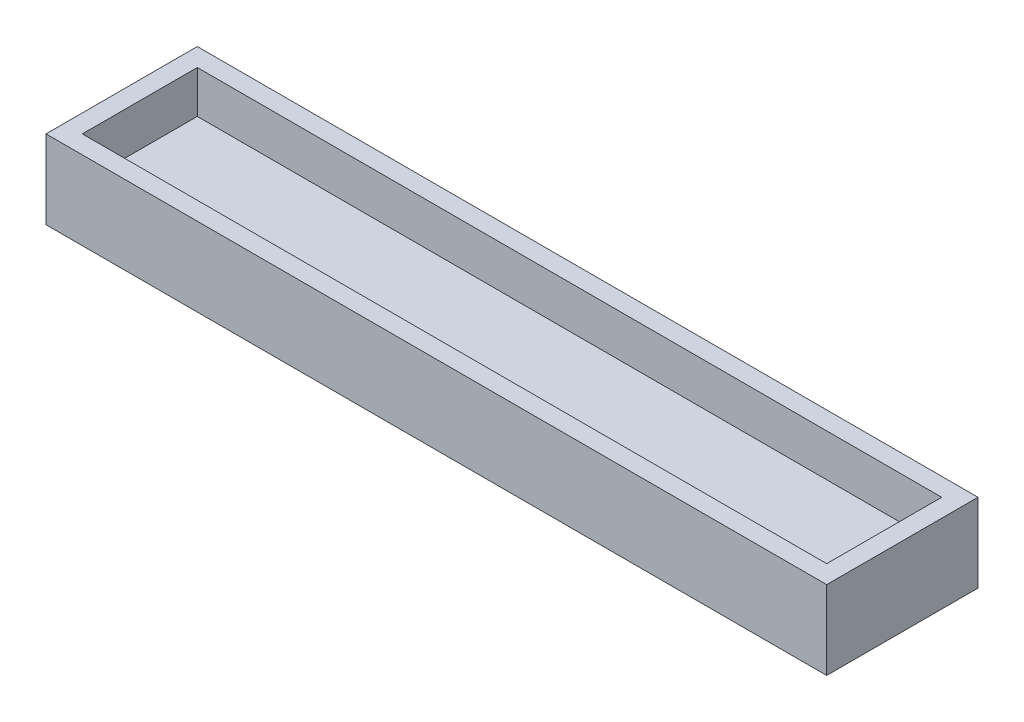
ISO-10303-21;
HEADER;
FILE_DESCRIPTION(('STEP AP214'),'2;1');
FILE_NAME('part.step','',(''),(''),'','','');
FILE_SCHEMA(('AUTOMOTIVE_DESIGN { 1 0 10303 214 1 1 1 1 }'));
ENDSEC;
DATA;
#1=APPLICATION_CONTEXT('core data for automotive mechanical design processes');
#2=APPLICATION_PROTOCOL_DEFINITION('international standard','automotive_design',2000,#1);
#3=PRODUCT_CONTEXT('',#1,'mechanical');
#4=PRODUCT('Part','Part','',(#3));
#5=PRODUCT_RELATED_PRODUCT_CATEGORY('part','',(#4));
#6=PRODUCT_DEFINITION_FORMATION('','',#4);
#7=PRODUCT_DEFINITION_CONTEXT('part definition',#1,'design');
#8=PRODUCT_DEFINITION('design','',#6,#7);
#9=PRODUCT_DEFINITION_SHAPE('','',#8);
#10=(LENGTH_UNIT() NAMED_UNIT(*) SI_UNIT(.MILLI.,.METRE.));
#11=(NAMED_UNIT(*) PLANE_ANGLE_UNIT() SI_UNIT($,.RADIAN.));
#12=(NAMED_UNIT(*) SI_UNIT($,.STERADIAN.) SOLID_ANGLE_UNIT());
#13=UNCERTAINTY_MEASURE_WITH_UNIT(LENGTH_MEASURE(1.E-05),#10,'distance_accuracy_value','');
#14=(GEOMETRIC_REPRESENTATION_CONTEXT(3) GLOBAL_UNCERTAINTY_ASSIGNED_CONTEXT((#13)) GLOBAL_UNIT_ASSIGNED_CONTEXT((#10,
#11,#12)) REPRESENTATION_CONTEXT('',''));
#15=CARTESIAN_POINT('',(0.,0.,0.));
#16=DIRECTION('',(0.,0.,1.));
#17=DIRECTION('',(1.,0.,0.));
#18=AXIS2_PLACEMENT_3D('',#15,#16,#17);
#19=CARTESIAN_POINT('',(0.,6.,0.));
#20=DIRECTION('',(0.,-1.,0.));
#21=DIRECTION('',(0.,0.,-1.));
#22=AXIS2_PLACEMENT_3D('',#19,#20,#21);
#23=PLANE('',#22);
#24=DIRECTION('',(0.,0.,1.));
#25=VECTOR('',#24,1.);
#26=CARTESIAN_POINT('',(0.,6.,0.));
#27=LINE('',#26,#25);
#28=CARTESIAN_POINT('',(0.,6.00000000000001,-19.));
#29=VERTEX_POINT('',#28);
#30=CARTESIAN_POINT('',(0.,6.,0.));
#31=VERTEX_POINT('',#30);
#32=EDGE_CURVE('E160',#29,#31,#27,.T.);
#33=ORIENTED_EDGE('',*,*,#32,.T.);
#34=DIRECTION('',(1.,0.,0.));
#35=VECTOR('',#34,1.);
#36=CARTESIAN_POINT('',(0.,6.,0.));
#37=LINE('',#36,#35);
#38=CARTESIAN_POINT('',(123.,6.00000000000001,0.));
#39=VERTEX_POINT('',#38);
#40=EDGE_CURVE('E164',#31,#39,#37,.T.);
#41=ORIENTED_EDGE('',*,*,#40,.T.);
#42=DIRECTION('',(0.,0.,-1.));
#43=VECTOR('',#42,1.);
#44=CARTESIAN_POINT('',(123.,6.,0.));
#45=LINE('',#44,#43);
#46=CARTESIAN_POINT('',(123.,6.00000000000001,-19.));
#47=VERTEX_POINT('',#46);
#48=EDGE_CURVE('E50',#39,#47,#45,.T.);
#49=ORIENTED_EDGE('',*,*,#48,.T.);
#50=DIRECTION('',(-1.,0.,0.));
#51=VECTOR('',#50,1.);
#52=CARTESIAN_POINT('',(0.,6.,-19.));
#53=LINE('',#52,#51);
#54=EDGE_CURVE('E12',#47,#29,#53,.T.);
#55=ORIENTED_EDGE('',*,*,#54,.T.);
#56=EDGE_LOOP('',(#33,#41,#49,#55));
#57=FACE_BOUND('',#56,.T.);
#58=ADVANCED_FACE('F41',(#57),#23,.F.);
#59=CARTESIAN_POINT('',(0.,151.400152206913,-19.));
#60=DIRECTION('',(0.,0.,-1.));
#61=DIRECTION('',(-1.,0.,0.));
#62=AXIS2_PLACEMENT_3D('',#59,#60,#61);
#63=PLANE('',#62);
#64=DIRECTION('',(0.,-1.,0.));
#65=VECTOR('',#64,1.);
#66=CARTESIAN_POINT('',(0.,151.400152206913,-19.));
#67=LINE('',#66,#65);
#68=CARTESIAN_POINT('',(0.,13.,-19.));
#69=VERTEX_POINT('',#68);
#70=EDGE_CURVE('E140',#69,#29,#67,.T.);
#71=ORIENTED_EDGE('',*,*,#70,.T.);
#72=ORIENTED_EDGE('',*,*,#54,.F.);
#73=DIRECTION('',(0.,-1.,0.));
#74=VECTOR('',#73,1.);
#75=CARTESIAN_POINT('',(123.,151.400152206913,-19.));
#76=LINE('',#75,#74);
#77=CARTESIAN_POINT('',(123.,13.,-19.));
#78=VERTEX_POINT('',#77);
#79=EDGE_CURVE('E177',#78,#47,#76,.T.);
#80=ORIENTED_EDGE('',*,*,#79,.F.);
#81=DIRECTION('',(-1.,0.,0.));
#82=VECTOR('',#81,1.);
#83=CARTESIAN_POINT('',(0.,13.,-19.));
#84=LINE('',#83,#82);
#85=EDGE_CURVE('E150',#78,#69,#84,.T.);
#86=ORIENTED_EDGE('',*,*,#85,.T.);
#87=EDGE_LOOP('',(#71,#72,#80,#86));
#88=FACE_BOUND('',#87,.T.);
#89=ADVANCED_FACE('F202',(#88),#63,.F.);
#90=CARTESIAN_POINT('',(123.,151.400152206913,0.));
#91=DIRECTION('',(1.,0.,0.));
#92=DIRECTION('',(0.,0.,-1.));
#93=AXIS2_PLACEMENT_3D('',#90,#91,#92);
#94=PLANE('',#93);
#95=ORIENTED_EDGE('',*,*,#79,.T.);
#96=ORIENTED_EDGE('',*,*,#48,.F.);
#97=DIRECTION('',(0.,-1.,0.));
#98=VECTOR('',#97,1.);
#99=CARTESIAN_POINT('',(123.,151.400152206913,0.));
#100=LINE('',#99,#98);
#101=CARTESIAN_POINT('',(123.,13.,0.));
#102=VERTEX_POINT('',#101);
#103=EDGE_CURVE('E137',#102,#39,#100,.T.);
#104=ORIENTED_EDGE('',*,*,#103,.F.);
#105=DIRECTION('',(0.,0.,-1.));
#106=VECTOR('',#105,1.);
#107=CARTESIAN_POINT('',(123.,13.,0.));
#108=LINE('',#107,#106);
#109=EDGE_CURVE('E195',#102,#78,#108,.T.);
#110=ORIENTED_EDGE('',*,*,#109,.T.);
#111=EDGE_LOOP('',(#95,#96,#104,#110));
#112=FACE_BOUND('',#111,.T.);
#113=ADVANCED_FACE('F174',(#112),#94,.F.);
#114=CARTESIAN_POINT('',(0.,151.400152206913,0.));
#115=DIRECTION('',(0.,0.,1.));
#116=DIRECTION('',(1.,0.,0.));
#117=AXIS2_PLACEMENT_3D('',#114,#115,#116);
#118=PLANE('',#117);
#119=ORIENTED_EDGE('',*,*,#103,.T.);
#120=ORIENTED_EDGE('',*,*,#40,.F.);
#121=DIRECTION('',(0.,-1.,0.));
#122=VECTOR('',#121,1.);
#123=CARTESIAN_POINT('',(0.,151.400152206913,0.));
#124=LINE('',#123,#122);
#125=CARTESIAN_POINT('',(0.,13.,0.));
#126=VERTEX_POINT('',#125);
#127=EDGE_CURVE('E57',#126,#31,#124,.T.);
#128=ORIENTED_EDGE('',*,*,#127,.F.);
#129=DIRECTION('',(1.,0.,0.));
#130=VECTOR('',#129,1.);
#131=CARTESIAN_POINT('',(0.,13.,0.));
#132=LINE('',#131,#130);
#133=EDGE_CURVE('E180',#126,#102,#132,.T.);
#134=ORIENTED_EDGE('',*,*,#133,.T.);
#135=EDGE_LOOP('',(#119,#120,#128,#134));
#136=FACE_BOUND('',#135,.T.);
#137=ADVANCED_FACE('F179',(#136),#118,.F.);
#138=CARTESIAN_POINT('',(0.,151.400152206913,0.));
#139=DIRECTION('',(-1.,0.,0.));
#140=DIRECTION('',(0.,0.,1.));
#141=AXIS2_PLACEMENT_3D('',#138,#139,#140);
#142=PLANE('',#141);
#143=ORIENTED_EDGE('',*,*,#127,.T.);
#144=ORIENTED_EDGE('',*,*,#32,.F.);
#145=ORIENTED_EDGE('',*,*,#70,.F.);
#146=DIRECTION('',(0.,0.,1.));
#147=VECTOR('',#146,1.);
#148=CARTESIAN_POINT('',(0.,13.,0.));
#149=LINE('',#148,#147);
#150=EDGE_CURVE('E187',#69,#126,#149,.T.);
#151=ORIENTED_EDGE('',*,*,#150,.T.);
#152=EDGE_LOOP('',(#143,#144,#145,#151));
#153=FACE_BOUND('',#152,.T.);
#154=ADVANCED_FACE('F205',(#153),#142,.F.);
#155=CARTESIAN_POINT('',(-3.,151.400152206913,3.));
#156=DIRECTION('',(-1.,0.,0.));
#157=DIRECTION('',(0.,0.,1.));
#158=AXIS2_PLACEMENT_3D('',#155,#156,#157);
#159=PLANE('',#158);
#160=DIRECTION('',(0.,0.,1.));
#161=VECTOR('',#160,1.);
#162=CARTESIAN_POINT('',(-3.,13.,3.));
#163=LINE('',#162,#161);
#164=CARTESIAN_POINT('',(-3.,13.,-22.));
#165=VERTEX_POINT('',#164);
#166=CARTESIAN_POINT('',(-3.,13.,3.));
#167=VERTEX_POINT('',#166);
#168=EDGE_CURVE('E165',#165,#167,#163,.T.);
#169=ORIENTED_EDGE('',*,*,#168,.F.);
#170=DIRECTION('',(0.,-1.,0.));
#171=VECTOR('',#170,1.);
#172=CARTESIAN_POINT('',(-3.,151.400152206913,-22.));
#173=LINE('',#172,#171);
#174=CARTESIAN_POINT('',(-3.,0.,-22.));
#175=VERTEX_POINT('',#174);
#176=EDGE_CURVE('E120',#165,#175,#173,.T.);
#177=ORIENTED_EDGE('',*,*,#176,.T.);
#178=DIRECTION('',(0.,0.,-1.));
#179=VECTOR('',#178,1.);
#180=CARTESIAN_POINT('',(-3.,0.,3.));
#181=LINE('',#180,#179);
#182=CARTESIAN_POINT('',(-3.,0.,3.));
#183=VERTEX_POINT('',#182);
#184=EDGE_CURVE('E124',#183,#175,#181,.T.);
#185=ORIENTED_EDGE('',*,*,#184,.F.);
#186=DIRECTION('',(0.,-1.,0.));
#187=VECTOR('',#186,1.);
#188=CARTESIAN_POINT('',(-3.,151.400152206913,3.));
#189=LINE('',#188,#187);
#190=EDGE_CURVE('E109',#167,#183,#189,.T.);
#191=ORIENTED_EDGE('',*,*,#190,.F.);
#192=EDGE_LOOP('',(#169,#177,#185,#191));
#193=FACE_BOUND('',#192,.T.);
#194=ADVANCED_FACE('F125',(#193),#159,.T.);
#195=CARTESIAN_POINT('',(-3.,151.400152206913,-22.));
#196=DIRECTION('',(0.,0.,-1.));
#197=DIRECTION('',(-1.,0.,0.));
#198=AXIS2_PLACEMENT_3D('',#195,#196,#197);
#199=PLANE('',#198);
#200=DIRECTION('',(-1.,0.,0.));
#201=VECTOR('',#200,1.);
#202=CARTESIAN_POINT('',(-3.,13.,-22.));
#203=LINE('',#202,#201);
#204=CARTESIAN_POINT('',(126.,13.,-22.));
#205=VERTEX_POINT('',#204);
#206=EDGE_CURVE('E159',#205,#165,#203,.T.);
#207=ORIENTED_EDGE('',*,*,#206,.F.);
#208=DIRECTION('',(0.,-1.,0.));
#209=VECTOR('',#208,1.);
#210=CARTESIAN_POINT('',(126.,151.400152206913,-22.));
#211=LINE('',#210,#209);
#212=CARTESIAN_POINT('',(126.,0.,-22.));
#213=VERTEX_POINT('',#212);
#214=EDGE_CURVE('E151',#205,#213,#211,.T.);
#215=ORIENTED_EDGE('',*,*,#214,.T.);
#216=DIRECTION('',(1.,0.,0.));
#217=VECTOR('',#216,1.);
#218=CARTESIAN_POINT('',(-3.,0.,-22.));
#219=LINE('',#218,#217);
#220=EDGE_CURVE('E131',#175,#213,#219,.T.);
#221=ORIENTED_EDGE('',*,*,#220,.F.);
#222=ORIENTED_EDGE('',*,*,#176,.F.);
#223=EDGE_LOOP('',(#207,#215,#221,#222));
#224=FACE_BOUND('',#223,.T.);
#225=ADVANCED_FACE('F213',(#224),#199,.T.);
#226=CARTESIAN_POINT('',(126.,151.400152206913,3.));
#227=DIRECTION('',(1.,0.,0.));
#228=DIRECTION('',(0.,0.,-1.));
#229=AXIS2_PLACEMENT_3D('',#226,#227,#228);
#230=PLANE('',#229);
#231=DIRECTION('',(0.,0.,-1.));
#232=VECTOR('',#231,1.);
#233=CARTESIAN_POINT('',(126.,13.,3.));
#234=LINE('',#233,#232);
#235=CARTESIAN_POINT('',(126.,13.,3.));
#236=VERTEX_POINT('',#235);
#237=EDGE_CURVE('E188',#236,#205,#234,.T.);
#238=ORIENTED_EDGE('',*,*,#237,.F.);
#239=DIRECTION('',(0.,-1.,0.));
#240=VECTOR('',#239,1.);
#241=CARTESIAN_POINT('',(126.,151.400152206913,3.));
#242=LINE('',#241,#240);
#243=CARTESIAN_POINT('',(126.,0.,3.));
#244=VERTEX_POINT('',#243);
#245=EDGE_CURVE('E147',#236,#244,#242,.T.);
#246=ORIENTED_EDGE('',*,*,#245,.T.);
#247=DIRECTION('',(0.,0.,1.));
#248=VECTOR('',#247,1.);
#249=CARTESIAN_POINT('',(126.,0.,3.));
#250=LINE('',#249,#248);
#251=EDGE_CURVE('E121',#213,#244,#250,.T.);
#252=ORIENTED_EDGE('',*,*,#251,.F.);
#253=ORIENTED_EDGE('',*,*,#214,.F.);
#254=EDGE_LOOP('',(#238,#246,#252,#253));
#255=FACE_BOUND('',#254,.T.);
#256=ADVANCED_FACE('F224',(#255),#230,.T.);
#257=CARTESIAN_POINT('',(-3.,151.400152206913,3.));
#258=DIRECTION('',(0.,0.,1.));
#259=DIRECTION('',(1.,0.,0.));
#260=AXIS2_PLACEMENT_3D('',#257,#258,#259);
#261=PLANE('',#260);
#262=DIRECTION('',(1.,0.,0.));
#263=VECTOR('',#262,1.);
#264=CARTESIAN_POINT('',(-3.,13.,3.));
#265=LINE('',#264,#263);
#266=EDGE_CURVE('E116',#167,#236,#265,.T.);
#267=ORIENTED_EDGE('',*,*,#266,.F.);
#268=ORIENTED_EDGE('',*,*,#190,.T.);
#269=DIRECTION('',(-1.,0.,0.));
#270=VECTOR('',#269,1.);
#271=CARTESIAN_POINT('',(-3.,0.,3.));
#272=LINE('',#271,#270);
#273=EDGE_CURVE('E114',#244,#183,#272,.T.);
#274=ORIENTED_EDGE('',*,*,#273,.F.);
#275=ORIENTED_EDGE('',*,*,#245,.F.);
#276=EDGE_LOOP('',(#267,#268,#274,#275));
#277=FACE_BOUND('',#276,.T.);
#278=ADVANCED_FACE('F111',(#277),#261,.T.);
#279=CARTESIAN_POINT('',(0.,13.,0.));
#280=DIRECTION('',(0.,-1.,0.));
#281=DIRECTION('',(0.,0.,-1.));
#282=AXIS2_PLACEMENT_3D('',#279,#280,#281);
#283=PLANE('',#282);
#284=ORIENTED_EDGE('',*,*,#266,.T.);
#285=ORIENTED_EDGE('',*,*,#237,.T.);
#286=ORIENTED_EDGE('',*,*,#206,.T.);
#287=ORIENTED_EDGE('',*,*,#168,.T.);
#288=EDGE_LOOP('',(#284,#285,#286,#287));
#289=FACE_BOUND('',#288,.T.);
#290=ORIENTED_EDGE('',*,*,#85,.F.);
#291=ORIENTED_EDGE('',*,*,#109,.F.);
#292=ORIENTED_EDGE('',*,*,#133,.F.);
#293=ORIENTED_EDGE('',*,*,#150,.F.);
#294=EDGE_LOOP('',(#290,#291,#292,#293));
#295=FACE_BOUND('',#294,.T.);
#296=ADVANCED_FACE('F204',(#289,#295),#283,.F.);
#297=CARTESIAN_POINT('',(0.,0.,0.));
#298=DIRECTION('',(0.,-1.,0.));
#299=DIRECTION('',(0.,0.,-1.));
#300=AXIS2_PLACEMENT_3D('',#297,#298,#299);
#301=PLANE('',#300);
#302=ORIENTED_EDGE('',*,*,#273,.T.);
#303=ORIENTED_EDGE('',*,*,#184,.T.);
#304=ORIENTED_EDGE('',*,*,#220,.T.);
#305=ORIENTED_EDGE('',*,*,#251,.T.);
#306=EDGE_LOOP('',(#302,#303,#304,#305));
#307=FACE_BOUND('',#306,.T.);
#308=ADVANCED_FACE('F43',(#307),#301,.T.);
#309=CLOSED_SHELL('',(#58,#89,#113,#137,#154,#194,#225,#256,#278,#296,#308));
#310=MANIFOLD_SOLID_BREP('B2',#309);
#311=ADVANCED_BREP_SHAPE_REPRESENTATION('',(#18,#310),#14);
#312=SHAPE_DEFINITION_REPRESENTATION(#9,#311);
ENDSEC;
END-ISO-10303-21;
